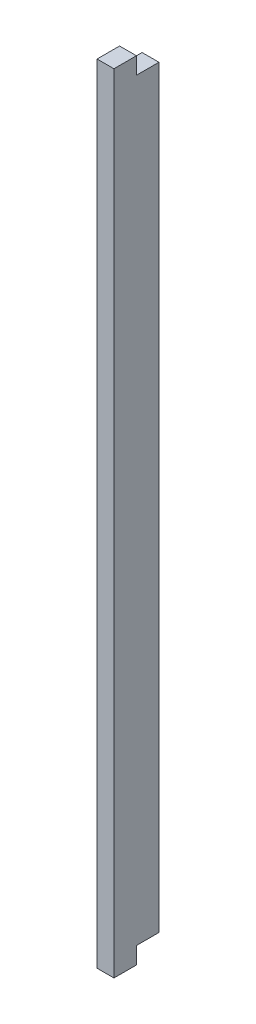
ISO-10303-21;
HEADER;
FILE_DESCRIPTION(('STEP AP214'),'2;1');
FILE_NAME('part.step','',(''),(''),'','','');
FILE_SCHEMA(('AUTOMOTIVE_DESIGN { 1 0 10303 214 1 1 1 1 }'));
ENDSEC;
DATA;
#1=APPLICATION_CONTEXT('core data for automotive mechanical design processes');
#2=APPLICATION_PROTOCOL_DEFINITION('international standard','automotive_design',2000,#1);
#3=PRODUCT_CONTEXT('',#1,'mechanical');
#4=PRODUCT('Part','Part','',(#3));
#5=PRODUCT_RELATED_PRODUCT_CATEGORY('part','',(#4));
#6=PRODUCT_DEFINITION_FORMATION('','',#4);
#7=PRODUCT_DEFINITION_CONTEXT('part definition',#1,'design');
#8=PRODUCT_DEFINITION('design','',#6,#7);
#9=PRODUCT_DEFINITION_SHAPE('','',#8);
#10=(LENGTH_UNIT() NAMED_UNIT(*) SI_UNIT(.MILLI.,.METRE.));
#11=(NAMED_UNIT(*) PLANE_ANGLE_UNIT() SI_UNIT($,.RADIAN.));
#12=(NAMED_UNIT(*) SI_UNIT($,.STERADIAN.) SOLID_ANGLE_UNIT());
#13=UNCERTAINTY_MEASURE_WITH_UNIT(LENGTH_MEASURE(1.E-05),#10,'distance_accuracy_value','');
#14=(GEOMETRIC_REPRESENTATION_CONTEXT(3) GLOBAL_UNCERTAINTY_ASSIGNED_CONTEXT((#13)) GLOBAL_UNIT_ASSIGNED_CONTEXT((#10,
#11,#12)) REPRESENTATION_CONTEXT('',''));
#15=CARTESIAN_POINT('',(0.,0.,0.));
#16=DIRECTION('',(0.,0.,1.));
#17=DIRECTION('',(1.,0.,0.));
#18=AXIS2_PLACEMENT_3D('',#15,#16,#17);
#19=CARTESIAN_POINT('',(1.5,-30.8441558441559,4.));
#20=DIRECTION('',(0.,0.,-1.));
#21=DIRECTION('',(-1.,0.,0.));
#22=AXIS2_PLACEMENT_3D('',#19,#20,#21);
#23=PLANE('',#22);
#24=DIRECTION('',(0.,-1.,0.));
#25=VECTOR('',#24,1.);
#26=CARTESIAN_POINT('',(0.,-30.8441558441559,4.));
#27=LINE('',#26,#25);
#28=CARTESIAN_POINT('',(0.,39.1558441558441,4.));
#29=VERTEX_POINT('',#28);
#30=CARTESIAN_POINT('',(0.,-30.8441558441559,4.));
#31=VERTEX_POINT('',#30);
#32=EDGE_CURVE('E137',#29,#31,#27,.T.);
#33=ORIENTED_EDGE('',*,*,#32,.T.);
#34=DIRECTION('',(-1.,0.,0.));
#35=VECTOR('',#34,1.);
#36=CARTESIAN_POINT('',(1.5,-30.8441558441559,4.));
#37=LINE('',#36,#35);
#38=CARTESIAN_POINT('',(1.5,-30.8441558441559,4.));
#39=VERTEX_POINT('',#38);
#40=EDGE_CURVE('E131',#39,#31,#37,.T.);
#41=ORIENTED_EDGE('',*,*,#40,.F.);
#42=DIRECTION('',(0.,-1.,0.));
#43=VECTOR('',#42,1.);
#44=CARTESIAN_POINT('',(1.5,-30.8441558441559,4.));
#45=LINE('',#44,#43);
#46=CARTESIAN_POINT('',(1.5,39.1558441558441,4.));
#47=VERTEX_POINT('',#46);
#48=EDGE_CURVE('E152',#47,#39,#45,.T.);
#49=ORIENTED_EDGE('',*,*,#48,.F.);
#50=DIRECTION('',(-1.,0.,0.));
#51=VECTOR('',#50,1.);
#52=CARTESIAN_POINT('',(1.5,39.1558441558441,4.));
#53=LINE('',#52,#51);
#54=EDGE_CURVE('E124',#47,#29,#53,.T.);
#55=ORIENTED_EDGE('',*,*,#54,.T.);
#56=EDGE_LOOP('',(#33,#41,#49,#55));
#57=FACE_BOUND('',#56,.T.);
#58=ADVANCED_FACE('F39',(#57),#23,.F.);
#59=CARTESIAN_POINT('',(1.5,-30.8441558441559,4.));
#60=DIRECTION('',(0.,1.,0.));
#61=DIRECTION('',(0.,0.,1.));
#62=AXIS2_PLACEMENT_3D('',#59,#60,#61);
#63=PLANE('',#62);
#64=DIRECTION('',(0.,0.,-1.));
#65=VECTOR('',#64,1.);
#66=CARTESIAN_POINT('',(0.,-30.8441558441559,4.));
#67=LINE('',#66,#65);
#68=CARTESIAN_POINT('',(0.,-30.8441558441559,2.));
#69=VERTEX_POINT('',#68);
#70=EDGE_CURVE('E141',#31,#69,#67,.T.);
#71=ORIENTED_EDGE('',*,*,#70,.T.);
#72=DIRECTION('',(1.,0.,0.));
#73=VECTOR('',#72,1.);
#74=CARTESIAN_POINT('',(-0.5,-30.8441558441559,2.));
#75=LINE('',#74,#73);
#76=CARTESIAN_POINT('',(1.5,-30.8441558441559,2.));
#77=VERTEX_POINT('',#76);
#78=EDGE_CURVE('E120',#69,#77,#75,.T.);
#79=ORIENTED_EDGE('',*,*,#78,.T.);
#80=DIRECTION('',(0.,0.,-1.));
#81=VECTOR('',#80,1.);
#82=CARTESIAN_POINT('',(1.5,-30.8441558441559,4.));
#83=LINE('',#82,#81);
#84=EDGE_CURVE('E133',#39,#77,#83,.T.);
#85=ORIENTED_EDGE('',*,*,#84,.F.);
#86=ORIENTED_EDGE('',*,*,#40,.T.);
#87=EDGE_LOOP('',(#71,#79,#85,#86));
#88=FACE_BOUND('',#87,.T.);
#89=ADVANCED_FACE('F196',(#88),#63,.F.);
#90=CARTESIAN_POINT('',(1.5,-30.8441558441559,0.));
#91=DIRECTION('',(0.,0.,1.));
#92=DIRECTION('',(1.,0.,0.));
#93=AXIS2_PLACEMENT_3D('',#90,#91,#92);
#94=PLANE('',#93);
#95=DIRECTION('',(0.,1.,0.));
#96=VECTOR('',#95,1.);
#97=CARTESIAN_POINT('',(0.,-30.8441558441559,0.));
#98=LINE('',#97,#96);
#99=CARTESIAN_POINT('',(0.,-29.3441558441559,0.));
#100=VERTEX_POINT('',#99);
#101=CARTESIAN_POINT('',(0.,37.6558441558441,0.));
#102=VERTEX_POINT('',#101);
#103=EDGE_CURVE('E146',#100,#102,#98,.T.);
#104=ORIENTED_EDGE('',*,*,#103,.T.);
#105=DIRECTION('',(1.,0.,0.));
#106=VECTOR('',#105,1.);
#107=CARTESIAN_POINT('',(-0.5,37.6558441558441,0.));
#108=LINE('',#107,#106);
#109=CARTESIAN_POINT('',(1.5,37.6558441558441,0.));
#110=VERTEX_POINT('',#109);
#111=EDGE_CURVE('E142',#102,#110,#108,.T.);
#112=ORIENTED_EDGE('',*,*,#111,.T.);
#113=DIRECTION('',(0.,1.,0.));
#114=VECTOR('',#113,1.);
#115=CARTESIAN_POINT('',(1.5,-30.8441558441559,0.));
#116=LINE('',#115,#114);
#117=CARTESIAN_POINT('',(1.5,-29.3441558441559,0.));
#118=VERTEX_POINT('',#117);
#119=EDGE_CURVE('E127',#118,#110,#116,.T.);
#120=ORIENTED_EDGE('',*,*,#119,.F.);
#121=DIRECTION('',(1.,0.,0.));
#122=VECTOR('',#121,1.);
#123=CARTESIAN_POINT('',(-0.5,-29.3441558441559,0.));
#124=LINE('',#123,#122);
#125=EDGE_CURVE('E174',#100,#118,#124,.T.);
#126=ORIENTED_EDGE('',*,*,#125,.F.);
#127=EDGE_LOOP('',(#104,#112,#120,#126));
#128=FACE_BOUND('',#127,.T.);
#129=ADVANCED_FACE('F178',(#128),#94,.F.);
#130=CARTESIAN_POINT('',(1.5,39.1558441558441,4.));
#131=DIRECTION('',(0.,-1.,0.));
#132=DIRECTION('',(0.,0.,-1.));
#133=AXIS2_PLACEMENT_3D('',#130,#131,#132);
#134=PLANE('',#133);
#135=DIRECTION('',(0.,0.,1.));
#136=VECTOR('',#135,1.);
#137=CARTESIAN_POINT('',(1.5,39.1558441558441,4.));
#138=LINE('',#137,#136);
#139=CARTESIAN_POINT('',(1.5,39.1558441558441,2.));
#140=VERTEX_POINT('',#139);
#141=EDGE_CURVE('E117',#140,#47,#138,.T.);
#142=ORIENTED_EDGE('',*,*,#141,.F.);
#143=DIRECTION('',(1.,0.,0.));
#144=VECTOR('',#143,1.);
#145=CARTESIAN_POINT('',(-0.5,39.1558441558441,2.));
#146=LINE('',#145,#144);
#147=CARTESIAN_POINT('',(0.,39.1558441558441,2.));
#148=VERTEX_POINT('',#147);
#149=EDGE_CURVE('E101',#148,#140,#146,.T.);
#150=ORIENTED_EDGE('',*,*,#149,.F.);
#151=DIRECTION('',(0.,0.,1.));
#152=VECTOR('',#151,1.);
#153=CARTESIAN_POINT('',(0.,39.1558441558441,4.));
#154=LINE('',#153,#152);
#155=EDGE_CURVE('E150',#148,#29,#154,.T.);
#156=ORIENTED_EDGE('',*,*,#155,.T.);
#157=ORIENTED_EDGE('',*,*,#54,.F.);
#158=EDGE_LOOP('',(#142,#150,#156,#157));
#159=FACE_BOUND('',#158,.T.);
#160=ADVANCED_FACE('F122',(#159),#134,.F.);
#161=CARTESIAN_POINT('',(1.5,0.,0.));
#162=DIRECTION('',(-1.,0.,0.));
#163=DIRECTION('',(0.,0.,1.));
#164=AXIS2_PLACEMENT_3D('',#161,#162,#163);
#165=PLANE('',#164);
#166=ORIENTED_EDGE('',*,*,#119,.T.);
#167=DIRECTION('',(0.,0.,-1.));
#168=VECTOR('',#167,1.);
#169=CARTESIAN_POINT('',(1.5,37.6558441558441,0.));
#170=LINE('',#169,#168);
#171=CARTESIAN_POINT('',(1.5,37.6558441558441,2.));
#172=VERTEX_POINT('',#171);
#173=EDGE_CURVE('E111',#172,#110,#170,.T.);
#174=ORIENTED_EDGE('',*,*,#173,.F.);
#175=DIRECTION('',(0.,-1.,0.));
#176=VECTOR('',#175,1.);
#177=CARTESIAN_POINT('',(1.5,39.1558441558441,2.));
#178=LINE('',#177,#176);
#179=EDGE_CURVE('E104',#140,#172,#178,.T.);
#180=ORIENTED_EDGE('',*,*,#179,.F.);
#181=ORIENTED_EDGE('',*,*,#141,.T.);
#182=ORIENTED_EDGE('',*,*,#48,.T.);
#183=ORIENTED_EDGE('',*,*,#84,.T.);
#184=DIRECTION('',(0.,-1.,0.));
#185=VECTOR('',#184,1.);
#186=CARTESIAN_POINT('',(1.5,-30.8441558441559,2.));
#187=LINE('',#186,#185);
#188=CARTESIAN_POINT('',(1.5,-29.3441558441559,2.));
#189=VERTEX_POINT('',#188);
#190=EDGE_CURVE('E181',#189,#77,#187,.T.);
#191=ORIENTED_EDGE('',*,*,#190,.F.);
#192=DIRECTION('',(0.,0.,1.));
#193=VECTOR('',#192,1.);
#194=CARTESIAN_POINT('',(1.5,-29.3441558441559,0.));
#195=LINE('',#194,#193);
#196=EDGE_CURVE('E186',#118,#189,#195,.T.);
#197=ORIENTED_EDGE('',*,*,#196,.F.);
#198=EDGE_LOOP('',(#166,#174,#180,#181,#182,#183,#191,#197));
#199=FACE_BOUND('',#198,.T.);
#200=ADVANCED_FACE('F115',(#199),#165,.F.);
#201=CARTESIAN_POINT('',(0.,0.,0.));
#202=DIRECTION('',(-1.,0.,0.));
#203=DIRECTION('',(0.,0.,1.));
#204=AXIS2_PLACEMENT_3D('',#201,#202,#203);
#205=PLANE('',#204);
#206=DIRECTION('',(0.,0.,1.));
#207=VECTOR('',#206,1.);
#208=CARTESIAN_POINT('',(0.,37.6558441558441,0.));
#209=LINE('',#208,#207);
#210=CARTESIAN_POINT('',(0.,37.6558441558441,2.));
#211=VERTEX_POINT('',#210);
#212=EDGE_CURVE('E11',#102,#211,#209,.T.);
#213=ORIENTED_EDGE('',*,*,#212,.F.);
#214=ORIENTED_EDGE('',*,*,#103,.F.);
#215=DIRECTION('',(0.,0.,-1.));
#216=VECTOR('',#215,1.);
#217=CARTESIAN_POINT('',(0.,-29.3441558441559,0.));
#218=LINE('',#217,#216);
#219=CARTESIAN_POINT('',(0.,-29.3441558441559,2.));
#220=VERTEX_POINT('',#219);
#221=EDGE_CURVE('E157',#220,#100,#218,.T.);
#222=ORIENTED_EDGE('',*,*,#221,.F.);
#223=DIRECTION('',(0.,1.,0.));
#224=VECTOR('',#223,1.);
#225=CARTESIAN_POINT('',(0.,0.,2.));
#226=LINE('',#225,#224);
#227=EDGE_CURVE('E160',#69,#220,#226,.T.);
#228=ORIENTED_EDGE('',*,*,#227,.F.);
#229=ORIENTED_EDGE('',*,*,#70,.F.);
#230=ORIENTED_EDGE('',*,*,#32,.F.);
#231=ORIENTED_EDGE('',*,*,#155,.F.);
#232=DIRECTION('',(0.,1.,0.));
#233=VECTOR('',#232,1.);
#234=CARTESIAN_POINT('',(0.,0.,2.));
#235=LINE('',#234,#233);
#236=EDGE_CURVE('E47',#211,#148,#235,.T.);
#237=ORIENTED_EDGE('',*,*,#236,.F.);
#238=EDGE_LOOP('',(#213,#214,#222,#228,#229,#230,#231,#237));
#239=FACE_BOUND('',#238,.T.);
#240=ADVANCED_FACE('F171',(#239),#205,.T.);
#241=CARTESIAN_POINT('',(-0.5,-30.8441558441559,2.));
#242=DIRECTION('',(0.,0.,1.));
#243=DIRECTION('',(1.,0.,0.));
#244=AXIS2_PLACEMENT_3D('',#241,#242,#243);
#245=PLANE('',#244);
#246=ORIENTED_EDGE('',*,*,#227,.T.);
#247=DIRECTION('',(1.,0.,0.));
#248=VECTOR('',#247,1.);
#249=CARTESIAN_POINT('',(-0.5,-29.3441558441559,2.));
#250=LINE('',#249,#248);
#251=EDGE_CURVE('E61',#220,#189,#250,.T.);
#252=ORIENTED_EDGE('',*,*,#251,.T.);
#253=ORIENTED_EDGE('',*,*,#190,.T.);
#254=ORIENTED_EDGE('',*,*,#78,.F.);
#255=EDGE_LOOP('',(#246,#252,#253,#254));
#256=FACE_BOUND('',#255,.T.);
#257=ADVANCED_FACE('F166',(#256),#245,.F.);
#258=CARTESIAN_POINT('',(-0.5,-29.3441558441559,0.));
#259=DIRECTION('',(0.,1.,0.));
#260=DIRECTION('',(0.,0.,1.));
#261=AXIS2_PLACEMENT_3D('',#258,#259,#260);
#262=PLANE('',#261);
#263=ORIENTED_EDGE('',*,*,#221,.T.);
#264=ORIENTED_EDGE('',*,*,#125,.T.);
#265=ORIENTED_EDGE('',*,*,#196,.T.);
#266=ORIENTED_EDGE('',*,*,#251,.F.);
#267=EDGE_LOOP('',(#263,#264,#265,#266));
#268=FACE_BOUND('',#267,.T.);
#269=ADVANCED_FACE('F173',(#268),#262,.F.);
#270=CARTESIAN_POINT('',(-0.5,37.6558441558441,0.));
#271=DIRECTION('',(0.,-1.,0.));
#272=DIRECTION('',(0.,0.,-1.));
#273=AXIS2_PLACEMENT_3D('',#270,#271,#272);
#274=PLANE('',#273);
#275=ORIENTED_EDGE('',*,*,#212,.T.);
#276=DIRECTION('',(1.,0.,0.));
#277=VECTOR('',#276,1.);
#278=CARTESIAN_POINT('',(-0.5,37.6558441558441,2.));
#279=LINE('',#278,#277);
#280=EDGE_CURVE('E54',#211,#172,#279,.T.);
#281=ORIENTED_EDGE('',*,*,#280,.T.);
#282=ORIENTED_EDGE('',*,*,#173,.T.);
#283=ORIENTED_EDGE('',*,*,#111,.F.);
#284=EDGE_LOOP('',(#275,#281,#282,#283));
#285=FACE_BOUND('',#284,.T.);
#286=ADVANCED_FACE('F207',(#285),#274,.F.);
#287=CARTESIAN_POINT('',(-0.5,39.1558441558441,2.));
#288=DIRECTION('',(0.,0.,1.));
#289=DIRECTION('',(1.,0.,0.));
#290=AXIS2_PLACEMENT_3D('',#287,#288,#289);
#291=PLANE('',#290);
#292=ORIENTED_EDGE('',*,*,#236,.T.);
#293=ORIENTED_EDGE('',*,*,#149,.T.);
#294=ORIENTED_EDGE('',*,*,#179,.T.);
#295=ORIENTED_EDGE('',*,*,#280,.F.);
#296=EDGE_LOOP('',(#292,#293,#294,#295));
#297=FACE_BOUND('',#296,.T.);
#298=ADVANCED_FACE('F103',(#297),#291,.F.);
#299=CLOSED_SHELL('',(#58,#89,#129,#160,#200,#240,#257,#269,#286,#298));
#300=MANIFOLD_SOLID_BREP('B2',#299);
#301=ADVANCED_BREP_SHAPE_REPRESENTATION('',(#18,#300),#14);
#302=SHAPE_DEFINITION_REPRESENTATION(#9,#301);
ENDSEC;
END-ISO-10303-21;
